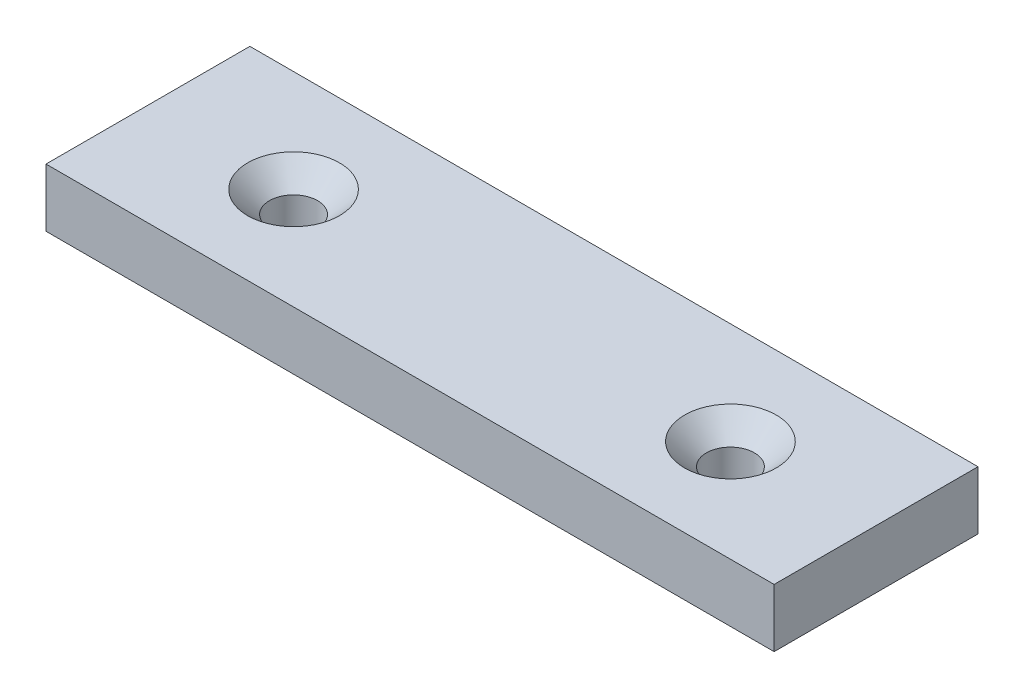
ISO-10303-21;
HEADER;
FILE_DESCRIPTION(('STEP AP214'),'2;1');
FILE_NAME('part.step','',(''),(''),'','','');
FILE_SCHEMA(('AUTOMOTIVE_DESIGN { 1 0 10303 214 1 1 1 1 }'));
ENDSEC;
DATA;
#1=APPLICATION_CONTEXT('core data for automotive mechanical design processes');
#2=APPLICATION_PROTOCOL_DEFINITION('international standard','automotive_design',2000,#1);
#3=PRODUCT_CONTEXT('',#1,'mechanical');
#4=PRODUCT('Part','Part','',(#3));
#5=PRODUCT_RELATED_PRODUCT_CATEGORY('part','',(#4));
#6=PRODUCT_DEFINITION_FORMATION('','',#4);
#7=PRODUCT_DEFINITION_CONTEXT('part definition',#1,'design');
#8=PRODUCT_DEFINITION('design','',#6,#7);
#9=PRODUCT_DEFINITION_SHAPE('','',#8);
#10=(LENGTH_UNIT() NAMED_UNIT(*) SI_UNIT(.MILLI.,.METRE.));
#11=(NAMED_UNIT(*) PLANE_ANGLE_UNIT() SI_UNIT($,.RADIAN.));
#12=(NAMED_UNIT(*) SI_UNIT($,.STERADIAN.) SOLID_ANGLE_UNIT());
#13=UNCERTAINTY_MEASURE_WITH_UNIT(LENGTH_MEASURE(1.E-05),#10,'distance_accuracy_value','');
#14=(GEOMETRIC_REPRESENTATION_CONTEXT(3) GLOBAL_UNCERTAINTY_ASSIGNED_CONTEXT((#13)) GLOBAL_UNIT_ASSIGNED_CONTEXT((#10,
#11,#12)) REPRESENTATION_CONTEXT('',''));
#15=CARTESIAN_POINT('',(0.,0.,0.));
#16=DIRECTION('',(0.,0.,1.));
#17=DIRECTION('',(1.,0.,0.));
#18=AXIS2_PLACEMENT_3D('',#15,#16,#17);
#19=CARTESIAN_POINT('',(50.,8.,-14.));
#20=DIRECTION('',(-1.,0.,0.));
#21=DIRECTION('',(0.,0.,1.));
#22=AXIS2_PLACEMENT_3D('',#19,#20,#21);
#23=PLANE('',#22);
#24=DIRECTION('',(0.,0.,-1.));
#25=VECTOR('',#24,1.);
#26=CARTESIAN_POINT('',(50.,0.,-14.));
#27=LINE('',#26,#25);
#28=CARTESIAN_POINT('',(50.,0.,14.));
#29=VERTEX_POINT('',#28);
#30=CARTESIAN_POINT('',(50.,0.,-14.));
#31=VERTEX_POINT('',#30);
#32=EDGE_CURVE('E96',#29,#31,#27,.T.);
#33=ORIENTED_EDGE('',*,*,#32,.T.);
#34=DIRECTION('',(0.,-1.,0.));
#35=VECTOR('',#34,1.);
#36=CARTESIAN_POINT('',(50.,8.,-14.));
#37=LINE('',#36,#35);
#38=CARTESIAN_POINT('',(50.,8.,-14.));
#39=VERTEX_POINT('',#38);
#40=EDGE_CURVE('E11',#39,#31,#37,.T.);
#41=ORIENTED_EDGE('',*,*,#40,.F.);
#42=DIRECTION('',(0.,0.,-1.));
#43=VECTOR('',#42,1.);
#44=CARTESIAN_POINT('',(50.,8.,-14.));
#45=LINE('',#44,#43);
#46=CARTESIAN_POINT('',(50.,8.,14.));
#47=VERTEX_POINT('',#46);
#48=EDGE_CURVE('E84',#47,#39,#45,.T.);
#49=ORIENTED_EDGE('',*,*,#48,.F.);
#50=DIRECTION('',(0.,-1.,0.));
#51=VECTOR('',#50,1.);
#52=CARTESIAN_POINT('',(50.,8.,14.));
#53=LINE('',#52,#51);
#54=EDGE_CURVE('E92',#47,#29,#53,.T.);
#55=ORIENTED_EDGE('',*,*,#54,.T.);
#56=EDGE_LOOP('',(#33,#41,#49,#55));
#57=FACE_BOUND('',#56,.T.);
#58=ADVANCED_FACE('F33',(#57),#23,.F.);
#59=CARTESIAN_POINT('',(-50.,8.,-14.));
#60=DIRECTION('',(0.,0.,1.));
#61=DIRECTION('',(1.,0.,0.));
#62=AXIS2_PLACEMENT_3D('',#59,#60,#61);
#63=PLANE('',#62);
#64=DIRECTION('',(-1.,0.,0.));
#65=VECTOR('',#64,1.);
#66=CARTESIAN_POINT('',(-50.,0.,-14.));
#67=LINE('',#66,#65);
#68=CARTESIAN_POINT('',(-50.,0.,-14.));
#69=VERTEX_POINT('',#68);
#70=EDGE_CURVE('E88',#31,#69,#67,.T.);
#71=ORIENTED_EDGE('',*,*,#70,.T.);
#72=DIRECTION('',(0.,-1.,0.));
#73=VECTOR('',#72,1.);
#74=CARTESIAN_POINT('',(-50.,8.,-14.));
#75=LINE('',#74,#73);
#76=CARTESIAN_POINT('',(-50.,8.,-14.));
#77=VERTEX_POINT('',#76);
#78=EDGE_CURVE('E41',#77,#69,#75,.T.);
#79=ORIENTED_EDGE('',*,*,#78,.F.);
#80=DIRECTION('',(-1.,0.,0.));
#81=VECTOR('',#80,1.);
#82=CARTESIAN_POINT('',(-50.,8.,-14.));
#83=LINE('',#82,#81);
#84=EDGE_CURVE('E79',#39,#77,#83,.T.);
#85=ORIENTED_EDGE('',*,*,#84,.F.);
#86=ORIENTED_EDGE('',*,*,#40,.T.);
#87=EDGE_LOOP('',(#71,#79,#85,#86));
#88=FACE_BOUND('',#87,.T.);
#89=ADVANCED_FACE('F87',(#88),#63,.F.);
#90=CARTESIAN_POINT('',(-50.,8.,-14.));
#91=DIRECTION('',(1.,0.,0.));
#92=DIRECTION('',(0.,0.,-1.));
#93=AXIS2_PLACEMENT_3D('',#90,#91,#92);
#94=PLANE('',#93);
#95=DIRECTION('',(0.,0.,1.));
#96=VECTOR('',#95,1.);
#97=CARTESIAN_POINT('',(-50.,0.,-14.));
#98=LINE('',#97,#96);
#99=CARTESIAN_POINT('',(-50.,0.,14.));
#100=VERTEX_POINT('',#99);
#101=EDGE_CURVE('E66',#69,#100,#98,.T.);
#102=ORIENTED_EDGE('',*,*,#101,.T.);
#103=DIRECTION('',(0.,-1.,0.));
#104=VECTOR('',#103,1.);
#105=CARTESIAN_POINT('',(-50.,8.,14.));
#106=LINE('',#105,#104);
#107=CARTESIAN_POINT('',(-50.,8.,14.));
#108=VERTEX_POINT('',#107);
#109=EDGE_CURVE('E89',#108,#100,#106,.T.);
#110=ORIENTED_EDGE('',*,*,#109,.F.);
#111=DIRECTION('',(0.,0.,1.));
#112=VECTOR('',#111,1.);
#113=CARTESIAN_POINT('',(-50.,8.,-14.));
#114=LINE('',#113,#112);
#115=EDGE_CURVE('E82',#77,#108,#114,.T.);
#116=ORIENTED_EDGE('',*,*,#115,.F.);
#117=ORIENTED_EDGE('',*,*,#78,.T.);
#118=EDGE_LOOP('',(#102,#110,#116,#117));
#119=FACE_BOUND('',#118,.T.);
#120=ADVANCED_FACE('F90',(#119),#94,.F.);
#121=CARTESIAN_POINT('',(-50.,8.,14.));
#122=DIRECTION('',(0.,0.,-1.));
#123=DIRECTION('',(-1.,0.,0.));
#124=AXIS2_PLACEMENT_3D('',#121,#122,#123);
#125=PLANE('',#124);
#126=DIRECTION('',(1.,0.,0.));
#127=VECTOR('',#126,1.);
#128=CARTESIAN_POINT('',(-50.,0.,14.));
#129=LINE('',#128,#127);
#130=EDGE_CURVE('E72',#100,#29,#129,.T.);
#131=ORIENTED_EDGE('',*,*,#130,.T.);
#132=ORIENTED_EDGE('',*,*,#54,.F.);
#133=DIRECTION('',(1.,0.,0.));
#134=VECTOR('',#133,1.);
#135=CARTESIAN_POINT('',(-50.,8.,14.));
#136=LINE('',#135,#134);
#137=EDGE_CURVE('E49',#108,#47,#136,.T.);
#138=ORIENTED_EDGE('',*,*,#137,.F.);
#139=ORIENTED_EDGE('',*,*,#109,.T.);
#140=EDGE_LOOP('',(#131,#132,#138,#139));
#141=FACE_BOUND('',#140,.T.);
#142=ADVANCED_FACE('F104',(#141),#125,.F.);
#143=CARTESIAN_POINT('',(0.,8.,0.));
#144=DIRECTION('',(0.,1.,0.));
#145=DIRECTION('',(0.,0.,1.));
#146=AXIS2_PLACEMENT_3D('',#143,#144,#145);
#147=PLANE('',#146);
#148=CARTESIAN_POINT('',(30.,8.,0.));
#149=DIRECTION('',(0.,1.,0.));
#150=DIRECTION('',(0.,0.,1.));
#151=AXIS2_PLACEMENT_3D('',#148,#149,#150);
#152=CIRCLE('',#151,6.3);
#153=CARTESIAN_POINT('',(30.,8.,6.3));
#154=VERTEX_POINT('',#153);
#155=EDGE_CURVE('E124',#154,#154,#152,.T.);
#156=ORIENTED_EDGE('',*,*,#155,.F.);
#157=EDGE_LOOP('',(#156));
#158=FACE_BOUND('',#157,.T.);
#159=CARTESIAN_POINT('',(-30.,8.,0.));
#160=DIRECTION('',(0.,1.,0.));
#161=DIRECTION('',(0.,0.,1.));
#162=AXIS2_PLACEMENT_3D('',#159,#160,#161);
#163=CIRCLE('',#162,6.3);
#164=CARTESIAN_POINT('',(-30.,8.,6.30000000000001));
#165=VERTEX_POINT('',#164);
#166=EDGE_CURVE('E115',#165,#165,#163,.T.);
#167=ORIENTED_EDGE('',*,*,#166,.F.);
#168=EDGE_LOOP('',(#167));
#169=FACE_BOUND('',#168,.T.);
#170=ORIENTED_EDGE('',*,*,#48,.T.);
#171=ORIENTED_EDGE('',*,*,#84,.T.);
#172=ORIENTED_EDGE('',*,*,#115,.T.);
#173=ORIENTED_EDGE('',*,*,#137,.T.);
#174=EDGE_LOOP('',(#170,#171,#172,#173));
#175=FACE_BOUND('',#174,.T.);
#176=ADVANCED_FACE('F80',(#158,#169,#175),#147,.T.);
#177=CARTESIAN_POINT('',(0.,0.,0.));
#178=DIRECTION('',(0.,1.,0.));
#179=DIRECTION('',(0.,0.,1.));
#180=AXIS2_PLACEMENT_3D('',#177,#178,#179);
#181=PLANE('',#180);
#182=CARTESIAN_POINT('',(30.,0.,0.));
#183=DIRECTION('',(0.,1.,0.));
#184=DIRECTION('',(0.,0.,1.));
#185=AXIS2_PLACEMENT_3D('',#182,#183,#184);
#186=CIRCLE('',#185,3.3);
#187=CARTESIAN_POINT('',(30.,0.,3.3));
#188=VERTEX_POINT('',#187);
#189=EDGE_CURVE('E118',#188,#188,#186,.T.);
#190=ORIENTED_EDGE('',*,*,#189,.T.);
#191=EDGE_LOOP('',(#190));
#192=FACE_BOUND('',#191,.T.);
#193=CARTESIAN_POINT('',(-30.,0.,0.));
#194=DIRECTION('',(0.,1.,0.));
#195=DIRECTION('',(0.,0.,1.));
#196=AXIS2_PLACEMENT_3D('',#193,#194,#195);
#197=CIRCLE('',#196,3.3);
#198=CARTESIAN_POINT('',(-30.,0.,3.3));
#199=VERTEX_POINT('',#198);
#200=EDGE_CURVE('E99',#199,#199,#197,.T.);
#201=ORIENTED_EDGE('',*,*,#200,.T.);
#202=EDGE_LOOP('',(#201));
#203=FACE_BOUND('',#202,.T.);
#204=ORIENTED_EDGE('',*,*,#32,.F.);
#205=ORIENTED_EDGE('',*,*,#130,.F.);
#206=ORIENTED_EDGE('',*,*,#101,.F.);
#207=ORIENTED_EDGE('',*,*,#70,.F.);
#208=EDGE_LOOP('',(#204,#205,#206,#207));
#209=FACE_BOUND('',#208,.T.);
#210=ADVANCED_FACE('F107',(#192,#203,#209),#181,.F.);
#211=CARTESIAN_POINT('',(-30.,8.,0.));
#212=DIRECTION('',(0.,1.,0.));
#213=DIRECTION('',(0.,0.,1.));
#214=AXIS2_PLACEMENT_3D('',#211,#212,#213);
#215=CYLINDRICAL_SURFACE('',#214,3.3);
#216=ORIENTED_EDGE('',*,*,#200,.F.);
#217=EDGE_LOOP('',(#216));
#218=FACE_BOUND('',#217,.T.);
#219=CARTESIAN_POINT('',(-30.,5.,0.));
#220=DIRECTION('',(0.,1.,0.));
#221=DIRECTION('',(0.,0.,1.));
#222=AXIS2_PLACEMENT_3D('',#219,#220,#221);
#223=CIRCLE('',#222,3.3);
#224=CARTESIAN_POINT('',(-30.,5.,3.3));
#225=VERTEX_POINT('',#224);
#226=EDGE_CURVE('E112',#225,#225,#223,.T.);
#227=ORIENTED_EDGE('',*,*,#226,.T.);
#228=EDGE_LOOP('',(#227));
#229=FACE_BOUND('',#228,.T.);
#230=ADVANCED_FACE('F138',(#218,#229),#215,.F.);
#231=CARTESIAN_POINT('',(-30.,8.,0.));
#232=DIRECTION('',(0.,1.,0.));
#233=DIRECTION('',(0.,0.,1.));
#234=AXIS2_PLACEMENT_3D('',#231,#232,#233);
#235=CONICAL_SURFACE('',#234,6.3,0.785398163397449);
#236=ORIENTED_EDGE('',*,*,#226,.F.);
#237=EDGE_LOOP('',(#236));
#238=FACE_BOUND('',#237,.T.);
#239=ORIENTED_EDGE('',*,*,#166,.T.);
#240=EDGE_LOOP('',(#239));
#241=FACE_BOUND('',#240,.T.);
#242=ADVANCED_FACE('F135',(#238,#241),#235,.F.);
#243=CARTESIAN_POINT('',(30.,8.,0.));
#244=DIRECTION('',(0.,1.,0.));
#245=DIRECTION('',(0.,0.,1.));
#246=AXIS2_PLACEMENT_3D('',#243,#244,#245);
#247=CYLINDRICAL_SURFACE('',#246,3.3);
#248=ORIENTED_EDGE('',*,*,#189,.F.);
#249=EDGE_LOOP('',(#248));
#250=FACE_BOUND('',#249,.T.);
#251=CARTESIAN_POINT('',(30.,5.,0.));
#252=DIRECTION('',(0.,1.,0.));
#253=DIRECTION('',(0.,0.,1.));
#254=AXIS2_PLACEMENT_3D('',#251,#252,#253);
#255=CIRCLE('',#254,3.3);
#256=CARTESIAN_POINT('',(30.,5.,3.3));
#257=VERTEX_POINT('',#256);
#258=EDGE_CURVE('E121',#257,#257,#255,.T.);
#259=ORIENTED_EDGE('',*,*,#258,.T.);
#260=EDGE_LOOP('',(#259));
#261=FACE_BOUND('',#260,.T.);
#262=ADVANCED_FACE('F137',(#250,#261),#247,.F.);
#263=CARTESIAN_POINT('',(30.,8.,0.));
#264=DIRECTION('',(0.,1.,0.));
#265=DIRECTION('',(0.,0.,1.));
#266=AXIS2_PLACEMENT_3D('',#263,#264,#265);
#267=CONICAL_SURFACE('',#266,6.3,0.785398163397449);
#268=ORIENTED_EDGE('',*,*,#258,.F.);
#269=EDGE_LOOP('',(#268));
#270=FACE_BOUND('',#269,.T.);
#271=ORIENTED_EDGE('',*,*,#155,.T.);
#272=EDGE_LOOP('',(#271));
#273=FACE_BOUND('',#272,.T.);
#274=ADVANCED_FACE('F128',(#270,#273),#267,.F.);
#275=CLOSED_SHELL('',(#58,#89,#120,#142,#176,#210,#230,#242,#262,#274));
#276=MANIFOLD_SOLID_BREP('B2',#275);
#277=ADVANCED_BREP_SHAPE_REPRESENTATION('',(#18,#276),#14);
#278=SHAPE_DEFINITION_REPRESENTATION(#9,#277);
ENDSEC;
END-ISO-10303-21;
